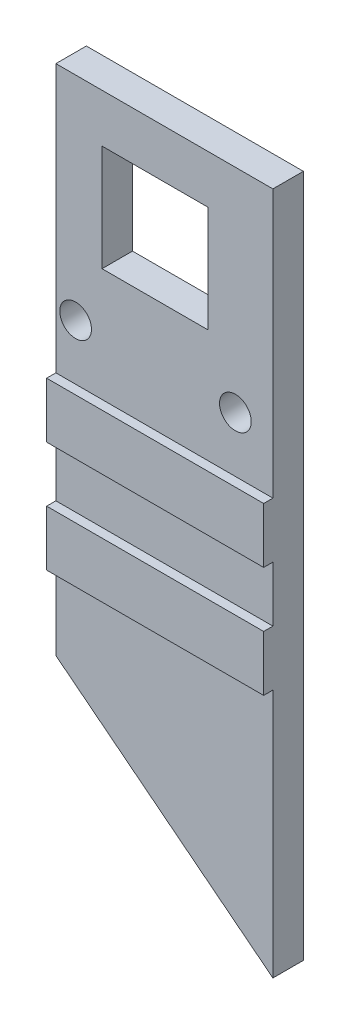
ISO-10303-21;
HEADER;
FILE_DESCRIPTION(('STEP AP214'),'2;1');
FILE_NAME('part.step','',(''),(''),'','','');
FILE_SCHEMA(('AUTOMOTIVE_DESIGN { 1 0 10303 214 1 1 1 1 }'));
ENDSEC;
DATA;
#1=APPLICATION_CONTEXT('core data for automotive mechanical design processes');
#2=APPLICATION_PROTOCOL_DEFINITION('international standard','automotive_design',2000,#1);
#3=PRODUCT_CONTEXT('',#1,'mechanical');
#4=PRODUCT('Part','Part','',(#3));
#5=PRODUCT_RELATED_PRODUCT_CATEGORY('part','',(#4));
#6=PRODUCT_DEFINITION_FORMATION('','',#4);
#7=PRODUCT_DEFINITION_CONTEXT('part definition',#1,'design');
#8=PRODUCT_DEFINITION('design','',#6,#7);
#9=PRODUCT_DEFINITION_SHAPE('','',#8);
#10=(LENGTH_UNIT() NAMED_UNIT(*) SI_UNIT(.MILLI.,.METRE.));
#11=(NAMED_UNIT(*) PLANE_ANGLE_UNIT() SI_UNIT($,.RADIAN.));
#12=(NAMED_UNIT(*) SI_UNIT($,.STERADIAN.) SOLID_ANGLE_UNIT());
#13=UNCERTAINTY_MEASURE_WITH_UNIT(LENGTH_MEASURE(1.E-05),#10,'distance_accuracy_value','');
#14=(GEOMETRIC_REPRESENTATION_CONTEXT(3) GLOBAL_UNCERTAINTY_ASSIGNED_CONTEXT((#13)) GLOBAL_UNIT_ASSIGNED_CONTEXT((#10,
#11,#12)) REPRESENTATION_CONTEXT('',''));
#15=CARTESIAN_POINT('',(0.,0.,0.));
#16=DIRECTION('',(0.,0.,1.));
#17=DIRECTION('',(1.,0.,0.));
#18=AXIS2_PLACEMENT_3D('',#15,#16,#17);
#19=CARTESIAN_POINT('',(0.,0.,3.3));
#20=DIRECTION('',(0.,0.,1.));
#21=DIRECTION('',(1.,0.,0.));
#22=AXIS2_PLACEMENT_3D('',#19,#20,#21);
#23=PLANE('',#22);
#24=DIRECTION('',(0.,1.,0.));
#25=VECTOR('',#24,1.);
#26=CARTESIAN_POINT('',(-10.7877192602988,0.,3.3));
#27=LINE('',#26,#25);
#28=CARTESIAN_POINT('',(-10.7877192602988,-22.3473246800366,3.3));
#29=VERTEX_POINT('',#28);
#30=CARTESIAN_POINT('',(-10.7877192602988,-13.8338220830736,3.3));
#31=VERTEX_POINT('',#30);
#32=EDGE_CURVE('E292',#29,#31,#27,.T.);
#33=ORIENTED_EDGE('',*,*,#32,.F.);
#34=DIRECTION('',(0.785948961590541,-0.618291379346947,0.));
#35=VECTOR('',#34,1.);
#36=CARTESIAN_POINT('',(-15.2539528353899,-18.8338220830736,3.3));
#37=LINE('',#36,#35);
#38=CARTESIAN_POINT('',(12.7122807397012,-40.8343360824678,3.3));
#39=VERTEX_POINT('',#38);
#40=EDGE_CURVE('E252',#29,#39,#37,.T.);
#41=ORIENTED_EDGE('',*,*,#40,.T.);
#42=DIRECTION('',(0.,-1.,0.));
#43=VECTOR('',#42,1.);
#44=CARTESIAN_POINT('',(12.7122807397012,0.,3.3));
#45=LINE('',#44,#43);
#46=CARTESIAN_POINT('',(12.7122807397012,-13.8338220830736,3.3));
#47=VERTEX_POINT('',#46);
#48=EDGE_CURVE('E62',#47,#39,#45,.T.);
#49=ORIENTED_EDGE('',*,*,#48,.F.);
#50=DIRECTION('',(1.,0.,0.));
#51=VECTOR('',#50,1.);
#52=CARTESIAN_POINT('',(-15.2539528353899,-13.8338220830736,3.3));
#53=LINE('',#52,#51);
#54=EDGE_CURVE('E189',#31,#47,#53,.T.);
#55=ORIENTED_EDGE('',*,*,#54,.F.);
#56=EDGE_LOOP('',(#33,#41,#49,#55));
#57=FACE_BOUND('',#56,.T.);
#58=ADVANCED_FACE('F40',(#57),#23,.T.);
#59=CARTESIAN_POINT('',(0.,0.,0.));
#60=DIRECTION('',(0.,0.,1.));
#61=DIRECTION('',(1.,0.,0.));
#62=AXIS2_PLACEMENT_3D('',#59,#60,#61);
#63=PLANE('',#62);
#64=DIRECTION('',(1.,0.,0.));
#65=VECTOR('',#64,1.);
#66=CARTESIAN_POINT('',(0.,27.9318613374807,0.));
#67=LINE('',#66,#65);
#68=CARTESIAN_POINT('',(-5.78771926029876,27.9318613374807,0.));
#69=VERTEX_POINT('',#68);
#70=CARTESIAN_POINT('',(5.71228073970124,27.9318613374807,0.));
#71=VERTEX_POINT('',#70);
#72=EDGE_CURVE('E177',#69,#71,#67,.T.);
#73=ORIENTED_EDGE('',*,*,#72,.F.);
#74=DIRECTION('',(0.,-1.,0.));
#75=VECTOR('',#74,1.);
#76=CARTESIAN_POINT('',(-5.78771926029876,0.,0.));
#77=LINE('',#76,#75);
#78=CARTESIAN_POINT('',(-5.78771926029876,16.4318613374807,0.));
#79=VERTEX_POINT('',#78);
#80=EDGE_CURVE('E218',#69,#79,#77,.T.);
#81=ORIENTED_EDGE('',*,*,#80,.T.);
#82=DIRECTION('',(1.,0.,0.));
#83=VECTOR('',#82,1.);
#84=CARTESIAN_POINT('',(0.,16.4318613374807,0.));
#85=LINE('',#84,#83);
#86=CARTESIAN_POINT('',(5.71228073970124,16.4318613374807,0.));
#87=VERTEX_POINT('',#86);
#88=EDGE_CURVE('E215',#79,#87,#85,.T.);
#89=ORIENTED_EDGE('',*,*,#88,.T.);
#90=DIRECTION('',(0.,-1.,0.));
#91=VECTOR('',#90,1.);
#92=CARTESIAN_POINT('',(5.71228073970124,0.,0.));
#93=LINE('',#92,#91);
#94=EDGE_CURVE('E180',#71,#87,#93,.T.);
#95=ORIENTED_EDGE('',*,*,#94,.F.);
#96=EDGE_LOOP('',(#73,#81,#89,#95));
#97=FACE_BOUND('',#96,.T.);
#98=CARTESIAN_POINT('',(-8.65,10.1661779169264,0.));
#99=DIRECTION('',(0.,0.,1.));
#100=DIRECTION('',(1.,0.,0.));
#101=AXIS2_PLACEMENT_3D('',#98,#99,#100);
#102=CIRCLE('',#101,1.71606969398137);
#103=CARTESIAN_POINT('',(-6.93393030601863,10.1661779169264,0.));
#104=VERTEX_POINT('',#103);
#105=EDGE_CURVE('E224',#104,#104,#102,.T.);
#106=ORIENTED_EDGE('',*,*,#105,.T.);
#107=EDGE_LOOP('',(#106));
#108=FACE_BOUND('',#107,.T.);
#109=CARTESIAN_POINT('',(8.65,10.1661779169264,0.));
#110=DIRECTION('',(0.,0.,1.));
#111=DIRECTION('',(1.,0.,0.));
#112=AXIS2_PLACEMENT_3D('',#109,#110,#111);
#113=CIRCLE('',#112,1.71606969398137);
#114=CARTESIAN_POINT('',(10.3660696939814,10.1661779169264,0.));
#115=VERTEX_POINT('',#114);
#116=EDGE_CURVE('E195',#115,#115,#113,.F.);
#117=ORIENTED_EDGE('',*,*,#116,.F.);
#118=EDGE_LOOP('',(#117));
#119=FACE_BOUND('',#118,.T.);
#120=DIRECTION('',(0.785948961590541,-0.618291379346947,0.));
#121=VECTOR('',#120,1.);
#122=CARTESIAN_POINT('',(-15.2539528353899,-18.8338220830736,0.));
#123=LINE('',#122,#121);
#124=CARTESIAN_POINT('',(-10.7877192602988,-22.3473246800366,0.));
#125=VERTEX_POINT('',#124);
#126=CARTESIAN_POINT('',(12.7122807397012,-40.8343360824678,0.));
#127=VERTEX_POINT('',#126);
#128=EDGE_CURVE('E246',#125,#127,#123,.T.);
#129=ORIENTED_EDGE('',*,*,#128,.F.);
#130=DIRECTION('',(0.,1.,0.));
#131=VECTOR('',#130,1.);
#132=CARTESIAN_POINT('',(-10.7877192602988,0.,0.));
#133=LINE('',#132,#131);
#134=CARTESIAN_POINT('',(-10.7877192602988,33.1661779169264,0.));
#135=VERTEX_POINT('',#134);
#136=EDGE_CURVE('E54',#125,#135,#133,.T.);
#137=ORIENTED_EDGE('',*,*,#136,.T.);
#138=DIRECTION('',(1.,0.,0.));
#139=VECTOR('',#138,1.);
#140=CARTESIAN_POINT('',(0.,33.1661779169264,0.));
#141=LINE('',#140,#139);
#142=CARTESIAN_POINT('',(12.7122807397012,33.1661779169264,0.));
#143=VERTEX_POINT('',#142);
#144=EDGE_CURVE('E221',#135,#143,#141,.T.);
#145=ORIENTED_EDGE('',*,*,#144,.T.);
#146=DIRECTION('',(0.,-1.,0.));
#147=VECTOR('',#146,1.);
#148=CARTESIAN_POINT('',(12.7122807397012,0.,0.));
#149=LINE('',#148,#147);
#150=EDGE_CURVE('E237',#143,#127,#149,.T.);
#151=ORIENTED_EDGE('',*,*,#150,.T.);
#152=EDGE_LOOP('',(#129,#137,#145,#151));
#153=FACE_BOUND('',#152,.T.);
#154=ADVANCED_FACE('F245',(#97,#108,#119,#153),#63,.F.);
#155=DIRECTION('',(0.,1.,0.));
#156=VECTOR('',#155,1.);
#157=CARTESIAN_POINT('',(-10.7877192602988,0.,3.3));
#158=LINE('',#157,#156);
#159=CARTESIAN_POINT('',(-10.7877192602988,-7.83382208307362,3.3));
#160=VERTEX_POINT('',#159);
#161=CARTESIAN_POINT('',(-10.7877192602988,-1.83382208307362,3.3));
#162=VERTEX_POINT('',#161);
#163=EDGE_CURVE('E298',#160,#162,#158,.T.);
#164=ORIENTED_EDGE('',*,*,#163,.F.);
#165=DIRECTION('',(-1.,0.,0.));
#166=VECTOR('',#165,1.);
#167=CARTESIAN_POINT('',(-15.2539528353899,-7.83382208307362,3.3));
#168=LINE('',#167,#166);
#169=CARTESIAN_POINT('',(12.7122807397012,-7.83382208307362,3.3));
#170=VERTEX_POINT('',#169);
#171=EDGE_CURVE('E262',#170,#160,#168,.T.);
#172=ORIENTED_EDGE('',*,*,#171,.F.);
#173=DIRECTION('',(0.,-1.,0.));
#174=VECTOR('',#173,1.);
#175=CARTESIAN_POINT('',(12.7122807397012,0.,3.3));
#176=LINE('',#175,#174);
#177=CARTESIAN_POINT('',(12.7122807397012,-1.83382208307362,3.3));
#178=VERTEX_POINT('',#177);
#179=EDGE_CURVE('E284',#178,#170,#176,.T.);
#180=ORIENTED_EDGE('',*,*,#179,.F.);
#181=DIRECTION('',(1.,0.,0.));
#182=VECTOR('',#181,1.);
#183=CARTESIAN_POINT('',(-15.2539528353899,-1.83382208307362,3.3));
#184=LINE('',#183,#182);
#185=EDGE_CURVE('E186',#162,#178,#184,.T.);
#186=ORIENTED_EDGE('',*,*,#185,.F.);
#187=EDGE_LOOP('',(#164,#172,#180,#186));
#188=FACE_BOUND('',#187,.T.);
#189=ADVANCED_FACE('F313',(#188),#23,.T.);
#190=DIRECTION('',(0.,1.,0.));
#191=VECTOR('',#190,1.);
#192=CARTESIAN_POINT('',(-10.7877192602988,0.,3.3));
#193=LINE('',#192,#191);
#194=CARTESIAN_POINT('',(-10.7877192602988,4.16617791692638,3.3));
#195=VERTEX_POINT('',#194);
#196=CARTESIAN_POINT('',(-10.7877192602988,33.1661779169264,3.3));
#197=VERTEX_POINT('',#196);
#198=EDGE_CURVE('E257',#195,#197,#193,.T.);
#199=ORIENTED_EDGE('',*,*,#198,.F.);
#200=DIRECTION('',(-1.,0.,0.));
#201=VECTOR('',#200,1.);
#202=CARTESIAN_POINT('',(-15.2539528353899,4.16617791692638,3.3));
#203=LINE('',#202,#201);
#204=CARTESIAN_POINT('',(12.7122807397012,4.16617791692637,3.3));
#205=VERTEX_POINT('',#204);
#206=EDGE_CURVE('E182',#205,#195,#203,.T.);
#207=ORIENTED_EDGE('',*,*,#206,.F.);
#208=DIRECTION('',(0.,-1.,0.));
#209=VECTOR('',#208,1.);
#210=CARTESIAN_POINT('',(12.7122807397012,0.,3.3));
#211=LINE('',#210,#209);
#212=CARTESIAN_POINT('',(12.7122807397012,33.1661779169264,3.3));
#213=VERTEX_POINT('',#212);
#214=EDGE_CURVE('E156',#213,#205,#211,.T.);
#215=ORIENTED_EDGE('',*,*,#214,.F.);
#216=DIRECTION('',(1.,0.,0.));
#217=VECTOR('',#216,1.);
#218=CARTESIAN_POINT('',(0.,33.1661779169264,3.3));
#219=LINE('',#218,#217);
#220=EDGE_CURVE('E203',#197,#213,#219,.T.);
#221=ORIENTED_EDGE('',*,*,#220,.F.);
#222=EDGE_LOOP('',(#199,#207,#215,#221));
#223=FACE_BOUND('',#222,.T.);
#224=CARTESIAN_POINT('',(8.65,10.1661779169264,3.3));
#225=DIRECTION('',(0.,0.,1.));
#226=DIRECTION('',(1.,0.,0.));
#227=AXIS2_PLACEMENT_3D('',#224,#225,#226);
#228=CIRCLE('',#227,1.71606969398137);
#229=CARTESIAN_POINT('',(10.3660696939814,10.1661779169264,3.3));
#230=VERTEX_POINT('',#229);
#231=EDGE_CURVE('E209',#230,#230,#228,.F.);
#232=ORIENTED_EDGE('',*,*,#231,.T.);
#233=EDGE_LOOP('',(#232));
#234=FACE_BOUND('',#233,.T.);
#235=CARTESIAN_POINT('',(-8.65,10.1661779169264,3.3));
#236=DIRECTION('',(0.,0.,1.));
#237=DIRECTION('',(1.,0.,0.));
#238=AXIS2_PLACEMENT_3D('',#235,#236,#237);
#239=CIRCLE('',#238,1.71606969398137);
#240=CARTESIAN_POINT('',(-6.93393030601863,10.1661779169264,3.3));
#241=VERTEX_POINT('',#240);
#242=EDGE_CURVE('E206',#241,#241,#239,.T.);
#243=ORIENTED_EDGE('',*,*,#242,.F.);
#244=EDGE_LOOP('',(#243));
#245=FACE_BOUND('',#244,.T.);
#246=DIRECTION('',(1.,0.,0.));
#247=VECTOR('',#246,1.);
#248=CARTESIAN_POINT('',(0.,27.9318613374807,3.3));
#249=LINE('',#248,#247);
#250=CARTESIAN_POINT('',(-5.78771926029876,27.9318613374807,3.3));
#251=VERTEX_POINT('',#250);
#252=CARTESIAN_POINT('',(5.71228073970124,27.9318613374807,3.3));
#253=VERTEX_POINT('',#252);
#254=EDGE_CURVE('E191',#251,#253,#249,.T.);
#255=ORIENTED_EDGE('',*,*,#254,.T.);
#256=DIRECTION('',(0.,-1.,0.));
#257=VECTOR('',#256,1.);
#258=CARTESIAN_POINT('',(5.71228073970124,0.,3.3));
#259=LINE('',#258,#257);
#260=CARTESIAN_POINT('',(5.71228073970124,16.4318613374807,3.3));
#261=VERTEX_POINT('',#260);
#262=EDGE_CURVE('E194',#253,#261,#259,.T.);
#263=ORIENTED_EDGE('',*,*,#262,.T.);
#264=DIRECTION('',(1.,0.,0.));
#265=VECTOR('',#264,1.);
#266=CARTESIAN_POINT('',(0.,16.4318613374807,3.3));
#267=LINE('',#266,#265);
#268=CARTESIAN_POINT('',(-5.78771926029876,16.4318613374807,3.3));
#269=VERTEX_POINT('',#268);
#270=EDGE_CURVE('E197',#269,#261,#267,.T.);
#271=ORIENTED_EDGE('',*,*,#270,.F.);
#272=DIRECTION('',(0.,-1.,0.));
#273=VECTOR('',#272,1.);
#274=CARTESIAN_POINT('',(-5.78771926029876,0.,3.3));
#275=LINE('',#274,#273);
#276=EDGE_CURVE('E200',#251,#269,#275,.T.);
#277=ORIENTED_EDGE('',*,*,#276,.F.);
#278=EDGE_LOOP('',(#255,#263,#271,#277));
#279=FACE_BOUND('',#278,.T.);
#280=ADVANCED_FACE('F310',(#223,#234,#245,#279),#23,.T.);
#281=CARTESIAN_POINT('',(0.,33.1661779169264,3.3));
#282=DIRECTION('',(0.,1.,0.));
#283=DIRECTION('',(0.,0.,1.));
#284=AXIS2_PLACEMENT_3D('',#281,#282,#283);
#285=PLANE('',#284);
#286=DIRECTION('',(0.,0.,1.));
#287=VECTOR('',#286,1.);
#288=CARTESIAN_POINT('',(-10.7877192602988,33.1661779169264,-7.));
#289=LINE('',#288,#287);
#290=EDGE_CURVE('E248',#135,#197,#289,.T.);
#291=ORIENTED_EDGE('',*,*,#290,.T.);
#292=ORIENTED_EDGE('',*,*,#220,.T.);
#293=DIRECTION('',(0.,0.,1.));
#294=VECTOR('',#293,1.);
#295=CARTESIAN_POINT('',(12.7122807397012,33.1661779169264,-7.));
#296=LINE('',#295,#294);
#297=EDGE_CURVE('E373',#143,#213,#296,.T.);
#298=ORIENTED_EDGE('',*,*,#297,.F.);
#299=ORIENTED_EDGE('',*,*,#144,.F.);
#300=EDGE_LOOP('',(#291,#292,#298,#299));
#301=FACE_BOUND('',#300,.T.);
#302=ADVANCED_FACE('F308',(#301),#285,.T.);
#303=CARTESIAN_POINT('',(0.,27.9318613374807,3.3));
#304=DIRECTION('',(0.,1.,0.));
#305=DIRECTION('',(0.,0.,1.));
#306=AXIS2_PLACEMENT_3D('',#303,#304,#305);
#307=PLANE('',#306);
#308=ORIENTED_EDGE('',*,*,#72,.T.);
#309=DIRECTION('',(0.,0.,-1.));
#310=VECTOR('',#309,1.);
#311=CARTESIAN_POINT('',(5.71228073970124,27.9318613374807,3.3));
#312=LINE('',#311,#310);
#313=EDGE_CURVE('E234',#253,#71,#312,.T.);
#314=ORIENTED_EDGE('',*,*,#313,.F.);
#315=ORIENTED_EDGE('',*,*,#254,.F.);
#316=DIRECTION('',(0.,0.,-1.));
#317=VECTOR('',#316,1.);
#318=CARTESIAN_POINT('',(-5.78771926029876,27.9318613374807,3.3));
#319=LINE('',#318,#317);
#320=EDGE_CURVE('E211',#251,#69,#319,.T.);
#321=ORIENTED_EDGE('',*,*,#320,.T.);
#322=EDGE_LOOP('',(#308,#314,#315,#321));
#323=FACE_BOUND('',#322,.T.);
#324=ADVANCED_FACE('F42',(#323),#307,.F.);
#325=CARTESIAN_POINT('',(5.71228073970124,0.,3.3));
#326=DIRECTION('',(1.,0.,0.));
#327=DIRECTION('',(0.,0.,-1.));
#328=AXIS2_PLACEMENT_3D('',#325,#326,#327);
#329=PLANE('',#328);
#330=ORIENTED_EDGE('',*,*,#94,.T.);
#331=DIRECTION('',(0.,0.,-1.));
#332=VECTOR('',#331,1.);
#333=CARTESIAN_POINT('',(5.71228073970124,16.4318613374807,3.3));
#334=LINE('',#333,#332);
#335=EDGE_CURVE('E232',#261,#87,#334,.T.);
#336=ORIENTED_EDGE('',*,*,#335,.F.);
#337=ORIENTED_EDGE('',*,*,#262,.F.);
#338=ORIENTED_EDGE('',*,*,#313,.T.);
#339=EDGE_LOOP('',(#330,#336,#337,#338));
#340=FACE_BOUND('',#339,.T.);
#341=ADVANCED_FACE('F327',(#340),#329,.F.);
#342=CARTESIAN_POINT('',(0.,16.4318613374807,3.3));
#343=DIRECTION('',(0.,1.,0.));
#344=DIRECTION('',(0.,0.,1.));
#345=AXIS2_PLACEMENT_3D('',#342,#343,#344);
#346=PLANE('',#345);
#347=ORIENTED_EDGE('',*,*,#88,.F.);
#348=DIRECTION('',(0.,0.,-1.));
#349=VECTOR('',#348,1.);
#350=CARTESIAN_POINT('',(-5.78771926029876,16.4318613374807,3.3));
#351=LINE('',#350,#349);
#352=EDGE_CURVE('E230',#269,#79,#351,.T.);
#353=ORIENTED_EDGE('',*,*,#352,.F.);
#354=ORIENTED_EDGE('',*,*,#270,.T.);
#355=ORIENTED_EDGE('',*,*,#335,.T.);
#356=EDGE_LOOP('',(#347,#353,#354,#355));
#357=FACE_BOUND('',#356,.T.);
#358=ADVANCED_FACE('F330',(#357),#346,.T.);
#359=CARTESIAN_POINT('',(-8.65,10.1661779169264,3.3));
#360=DIRECTION('',(0.,0.,-1.));
#361=DIRECTION('',(-1.,0.,0.));
#362=AXIS2_PLACEMENT_3D('',#359,#360,#361);
#363=CYLINDRICAL_SURFACE('',#362,1.71606969398137);
#364=ORIENTED_EDGE('',*,*,#242,.T.);
#365=EDGE_LOOP('',(#364));
#366=FACE_BOUND('',#365,.T.);
#367=ORIENTED_EDGE('',*,*,#105,.F.);
#368=EDGE_LOOP('',(#367));
#369=FACE_BOUND('',#368,.T.);
#370=ADVANCED_FACE('F353',(#366,#369),#363,.F.);
#371=CARTESIAN_POINT('',(-5.78771926029876,0.,3.3));
#372=DIRECTION('',(1.,0.,0.));
#373=DIRECTION('',(0.,0.,-1.));
#374=AXIS2_PLACEMENT_3D('',#371,#372,#373);
#375=PLANE('',#374);
#376=ORIENTED_EDGE('',*,*,#80,.F.);
#377=ORIENTED_EDGE('',*,*,#320,.F.);
#378=ORIENTED_EDGE('',*,*,#276,.T.);
#379=ORIENTED_EDGE('',*,*,#352,.T.);
#380=EDGE_LOOP('',(#376,#377,#378,#379));
#381=FACE_BOUND('',#380,.T.);
#382=ADVANCED_FACE('F333',(#381),#375,.T.);
#383=CARTESIAN_POINT('',(8.65,10.1661779169264,3.3));
#384=DIRECTION('',(0.,0.,-1.));
#385=DIRECTION('',(-1.,0.,0.));
#386=AXIS2_PLACEMENT_3D('',#383,#384,#385);
#387=CYLINDRICAL_SURFACE('',#386,1.71606969398137);
#388=ORIENTED_EDGE('',*,*,#231,.F.);
#389=EDGE_LOOP('',(#388));
#390=FACE_BOUND('',#389,.T.);
#391=ORIENTED_EDGE('',*,*,#116,.T.);
#392=EDGE_LOOP('',(#391));
#393=FACE_BOUND('',#392,.T.);
#394=ADVANCED_FACE('F342',(#390,#393),#387,.F.);
#395=CARTESIAN_POINT('',(-15.2539528353899,-1.83382208307362,4.3));
#396=DIRECTION('',(0.,1.,0.));
#397=DIRECTION('',(-1.,0.,0.));
#398=AXIS2_PLACEMENT_3D('',#395,#396,#397);
#399=PLANE('',#398);
#400=DIRECTION('',(1.,0.,0.));
#401=VECTOR('',#400,1.);
#402=CARTESIAN_POINT('',(-15.2539528353899,-1.83382208307362,4.3));
#403=LINE('',#402,#401);
#404=CARTESIAN_POINT('',(-10.7877192602988,-1.83382208307362,4.3));
#405=VERTEX_POINT('',#404);
#406=CARTESIAN_POINT('',(12.7122807397012,-1.83382208307362,4.3));
#407=VERTEX_POINT('',#406);
#408=EDGE_CURVE('E170',#405,#407,#403,.T.);
#409=ORIENTED_EDGE('',*,*,#408,.F.);
#410=DIRECTION('',(0.,0.,-1.));
#411=VECTOR('',#410,1.);
#412=CARTESIAN_POINT('',(-10.7877192602988,-1.83382208307362,4.3));
#413=LINE('',#412,#411);
#414=EDGE_CURVE('E300',#405,#162,#413,.T.);
#415=ORIENTED_EDGE('',*,*,#414,.T.);
#416=ORIENTED_EDGE('',*,*,#185,.T.);
#417=DIRECTION('',(0.,0.,1.));
#418=VECTOR('',#417,1.);
#419=CARTESIAN_POINT('',(12.7122807397012,-1.83382208307362,4.3));
#420=LINE('',#419,#418);
#421=EDGE_CURVE('E161',#178,#407,#420,.T.);
#422=ORIENTED_EDGE('',*,*,#421,.T.);
#423=EDGE_LOOP('',(#409,#415,#416,#422));
#424=FACE_BOUND('',#423,.T.);
#425=ADVANCED_FACE('F344',(#424),#399,.F.);
#426=CARTESIAN_POINT('',(-15.2539528353899,4.16617791692638,4.3));
#427=DIRECTION('',(0.,-1.,0.));
#428=DIRECTION('',(1.,0.,0.));
#429=AXIS2_PLACEMENT_3D('',#426,#427,#428);
#430=PLANE('',#429);
#431=ORIENTED_EDGE('',*,*,#206,.T.);
#432=DIRECTION('',(0.,0.,1.));
#433=VECTOR('',#432,1.);
#434=CARTESIAN_POINT('',(-10.7877192602988,4.16617791692638,4.3));
#435=LINE('',#434,#433);
#436=CARTESIAN_POINT('',(-10.7877192602988,4.16617791692638,4.3));
#437=VERTEX_POINT('',#436);
#438=EDGE_CURVE('E176',#195,#437,#435,.T.);
#439=ORIENTED_EDGE('',*,*,#438,.T.);
#440=DIRECTION('',(-1.,0.,0.));
#441=VECTOR('',#440,1.);
#442=CARTESIAN_POINT('',(-15.2539528353899,4.16617791692638,4.3));
#443=LINE('',#442,#441);
#444=CARTESIAN_POINT('',(12.7122807397012,4.16617791692638,4.3));
#445=VERTEX_POINT('',#444);
#446=EDGE_CURVE('E168',#445,#437,#443,.T.);
#447=ORIENTED_EDGE('',*,*,#446,.F.);
#448=DIRECTION('',(0.,0.,-1.));
#449=VECTOR('',#448,1.);
#450=CARTESIAN_POINT('',(12.7122807397012,4.16617791692637,4.3));
#451=LINE('',#450,#449);
#452=EDGE_CURVE('E150',#445,#205,#451,.T.);
#453=ORIENTED_EDGE('',*,*,#452,.T.);
#454=EDGE_LOOP('',(#431,#439,#447,#453));
#455=FACE_BOUND('',#454,.T.);
#456=ADVANCED_FACE('F175',(#455),#430,.F.);
#457=CARTESIAN_POINT('',(0.,0.,4.3));
#458=DIRECTION('',(0.,0.,1.));
#459=DIRECTION('',(1.,0.,0.));
#460=AXIS2_PLACEMENT_3D('',#457,#458,#459);
#461=PLANE('',#460);
#462=DIRECTION('',(0.,1.,0.));
#463=VECTOR('',#462,1.);
#464=CARTESIAN_POINT('',(-10.7877192602988,33.1661779169264,4.3));
#465=LINE('',#464,#463);
#466=EDGE_CURVE('E171',#405,#437,#465,.T.);
#467=ORIENTED_EDGE('',*,*,#466,.F.);
#468=ORIENTED_EDGE('',*,*,#408,.T.);
#469=DIRECTION('',(0.,-1.,0.));
#470=VECTOR('',#469,1.);
#471=CARTESIAN_POINT('',(12.7122807397012,33.1661779169264,4.3));
#472=LINE('',#471,#470);
#473=EDGE_CURVE('E153',#445,#407,#472,.T.);
#474=ORIENTED_EDGE('',*,*,#473,.F.);
#475=ORIENTED_EDGE('',*,*,#446,.T.);
#476=EDGE_LOOP('',(#467,#468,#474,#475));
#477=FACE_BOUND('',#476,.T.);
#478=ADVANCED_FACE('F167',(#477),#461,.T.);
#479=CARTESIAN_POINT('',(-15.2539528353899,-13.8338220830736,4.3));
#480=DIRECTION('',(0.,1.,0.));
#481=DIRECTION('',(-1.,0.,0.));
#482=AXIS2_PLACEMENT_3D('',#479,#480,#481);
#483=PLANE('',#482);
#484=DIRECTION('',(1.,0.,0.));
#485=VECTOR('',#484,1.);
#486=CARTESIAN_POINT('',(-15.2539528353899,-13.8338220830736,4.3));
#487=LINE('',#486,#485);
#488=CARTESIAN_POINT('',(-10.7877192602988,-13.8338220830736,4.3));
#489=VERTEX_POINT('',#488);
#490=CARTESIAN_POINT('',(12.7122807397012,-13.8338220830736,4.3));
#491=VERTEX_POINT('',#490);
#492=EDGE_CURVE('E255',#489,#491,#487,.T.);
#493=ORIENTED_EDGE('',*,*,#492,.F.);
#494=DIRECTION('',(0.,0.,-1.));
#495=VECTOR('',#494,1.);
#496=CARTESIAN_POINT('',(-10.7877192602988,-13.8338220830736,4.3));
#497=LINE('',#496,#495);
#498=EDGE_CURVE('E278',#489,#31,#497,.T.);
#499=ORIENTED_EDGE('',*,*,#498,.T.);
#500=ORIENTED_EDGE('',*,*,#54,.T.);
#501=DIRECTION('',(0.,0.,1.));
#502=VECTOR('',#501,1.);
#503=CARTESIAN_POINT('',(12.7122807397012,-13.8338220830736,4.3));
#504=LINE('',#503,#502);
#505=EDGE_CURVE('E280',#47,#491,#504,.T.);
#506=ORIENTED_EDGE('',*,*,#505,.T.);
#507=EDGE_LOOP('',(#493,#499,#500,#506));
#508=FACE_BOUND('',#507,.T.);
#509=ADVANCED_FACE('F277',(#508),#483,.F.);
#510=CARTESIAN_POINT('',(-15.2539528353899,-7.83382208307362,4.3));
#511=DIRECTION('',(0.,-1.,0.));
#512=DIRECTION('',(0.,0.,-1.));
#513=AXIS2_PLACEMENT_3D('',#510,#511,#512);
#514=PLANE('',#513);
#515=ORIENTED_EDGE('',*,*,#171,.T.);
#516=DIRECTION('',(0.,0.,1.));
#517=VECTOR('',#516,1.);
#518=CARTESIAN_POINT('',(-10.7877192602988,-7.83382208307362,4.3));
#519=LINE('',#518,#517);
#520=CARTESIAN_POINT('',(-10.7877192602988,-7.83382208307362,4.3));
#521=VERTEX_POINT('',#520);
#522=EDGE_CURVE('E295',#160,#521,#519,.T.);
#523=ORIENTED_EDGE('',*,*,#522,.T.);
#524=DIRECTION('',(-1.,0.,0.));
#525=VECTOR('',#524,1.);
#526=CARTESIAN_POINT('',(-15.2539528353899,-7.83382208307362,4.3));
#527=LINE('',#526,#525);
#528=CARTESIAN_POINT('',(12.7122807397012,-7.83382208307362,4.3));
#529=VERTEX_POINT('',#528);
#530=EDGE_CURVE('E251',#529,#521,#527,.T.);
#531=ORIENTED_EDGE('',*,*,#530,.F.);
#532=DIRECTION('',(0.,0.,-1.));
#533=VECTOR('',#532,1.);
#534=CARTESIAN_POINT('',(12.7122807397012,-7.83382208307362,4.3));
#535=LINE('',#534,#533);
#536=EDGE_CURVE('E281',#529,#170,#535,.T.);
#537=ORIENTED_EDGE('',*,*,#536,.T.);
#538=EDGE_LOOP('',(#515,#523,#531,#537));
#539=FACE_BOUND('',#538,.T.);
#540=ADVANCED_FACE('F370',(#539),#514,.F.);
#541=CARTESIAN_POINT('',(0.,0.,4.3));
#542=DIRECTION('',(0.,0.,1.));
#543=DIRECTION('',(1.,0.,0.));
#544=AXIS2_PLACEMENT_3D('',#541,#542,#543);
#545=PLANE('',#544);
#546=EDGE_CURVE('E273',#489,#521,#465,.T.);
#547=ORIENTED_EDGE('',*,*,#546,.F.);
#548=ORIENTED_EDGE('',*,*,#492,.T.);
#549=EDGE_CURVE('E172',#529,#491,#472,.T.);
#550=ORIENTED_EDGE('',*,*,#549,.F.);
#551=ORIENTED_EDGE('',*,*,#530,.T.);
#552=EDGE_LOOP('',(#547,#548,#550,#551));
#553=FACE_BOUND('',#552,.T.);
#554=ADVANCED_FACE('F271',(#553),#545,.T.);
#555=CARTESIAN_POINT('',(-15.2539528353899,-18.8338220830736,0.));
#556=DIRECTION('',(-0.618291379346947,-0.785948961590541,0.));
#557=DIRECTION('',(0.785948961590541,-0.618291379346947,0.));
#558=AXIS2_PLACEMENT_3D('',#555,#556,#557);
#559=PLANE('',#558);
#560=DIRECTION('',(0.,0.,1.));
#561=VECTOR('',#560,1.);
#562=CARTESIAN_POINT('',(-10.7877192602988,-22.3473246800366,0.));
#563=LINE('',#562,#561);
#564=EDGE_CURVE('E11',#125,#29,#563,.T.);
#565=ORIENTED_EDGE('',*,*,#564,.F.);
#566=ORIENTED_EDGE('',*,*,#128,.T.);
#567=DIRECTION('',(0.,0.,-1.));
#568=VECTOR('',#567,1.);
#569=CARTESIAN_POINT('',(12.7122807397012,-40.8343360824678,0.));
#570=LINE('',#569,#568);
#571=EDGE_CURVE('E48',#39,#127,#570,.T.);
#572=ORIENTED_EDGE('',*,*,#571,.F.);
#573=ORIENTED_EDGE('',*,*,#40,.F.);
#574=EDGE_LOOP('',(#565,#566,#572,#573));
#575=FACE_BOUND('',#574,.T.);
#576=ADVANCED_FACE('F250',(#575),#559,.T.);
#577=CARTESIAN_POINT('',(12.7122807397012,33.1661779169264,-7.));
#578=DIRECTION('',(-1.,0.,0.));
#579=DIRECTION('',(0.,-1.,0.));
#580=AXIS2_PLACEMENT_3D('',#577,#578,#579);
#581=PLANE('',#580);
#582=ORIENTED_EDGE('',*,*,#214,.T.);
#583=ORIENTED_EDGE('',*,*,#452,.F.);
#584=ORIENTED_EDGE('',*,*,#473,.T.);
#585=ORIENTED_EDGE('',*,*,#421,.F.);
#586=ORIENTED_EDGE('',*,*,#179,.T.);
#587=ORIENTED_EDGE('',*,*,#536,.F.);
#588=ORIENTED_EDGE('',*,*,#549,.T.);
#589=ORIENTED_EDGE('',*,*,#505,.F.);
#590=ORIENTED_EDGE('',*,*,#48,.T.);
#591=ORIENTED_EDGE('',*,*,#571,.T.);
#592=ORIENTED_EDGE('',*,*,#150,.F.);
#593=ORIENTED_EDGE('',*,*,#297,.T.);
#594=EDGE_LOOP('',(#582,#583,#584,#585,#586,#587,#588,#589,#590,#591,#592,#593));
#595=FACE_BOUND('',#594,.T.);
#596=ADVANCED_FACE('F152',(#595),#581,.F.);
#597=CARTESIAN_POINT('',(-10.7877192602988,33.1661779169264,-7.));
#598=DIRECTION('',(1.,0.,0.));
#599=DIRECTION('',(0.,1.,0.));
#600=AXIS2_PLACEMENT_3D('',#597,#598,#599);
#601=PLANE('',#600);
#602=ORIENTED_EDGE('',*,*,#198,.T.);
#603=ORIENTED_EDGE('',*,*,#290,.F.);
#604=ORIENTED_EDGE('',*,*,#136,.F.);
#605=ORIENTED_EDGE('',*,*,#564,.T.);
#606=ORIENTED_EDGE('',*,*,#32,.T.);
#607=ORIENTED_EDGE('',*,*,#498,.F.);
#608=ORIENTED_EDGE('',*,*,#546,.T.);
#609=ORIENTED_EDGE('',*,*,#522,.F.);
#610=ORIENTED_EDGE('',*,*,#163,.T.);
#611=ORIENTED_EDGE('',*,*,#414,.F.);
#612=ORIENTED_EDGE('',*,*,#466,.T.);
#613=ORIENTED_EDGE('',*,*,#438,.F.);
#614=EDGE_LOOP('',(#602,#603,#604,#605,#606,#607,#608,#609,#610,#611,#612,#613));
#615=FACE_BOUND('',#614,.T.);
#616=ADVANCED_FACE('F304',(#615),#601,.F.);
#617=CLOSED_SHELL('',(#58,#154,#189,#280,#302,#324,#341,#358,#370,#382,#394,#425,#456,#478,#509,
#540,#554,#576,#596,#616));
#618=MANIFOLD_SOLID_BREP('B2',#617);
#619=ADVANCED_BREP_SHAPE_REPRESENTATION('',(#18,#618),#14);
#620=SHAPE_DEFINITION_REPRESENTATION(#9,#619);
ENDSEC;
END-ISO-10303-21;
